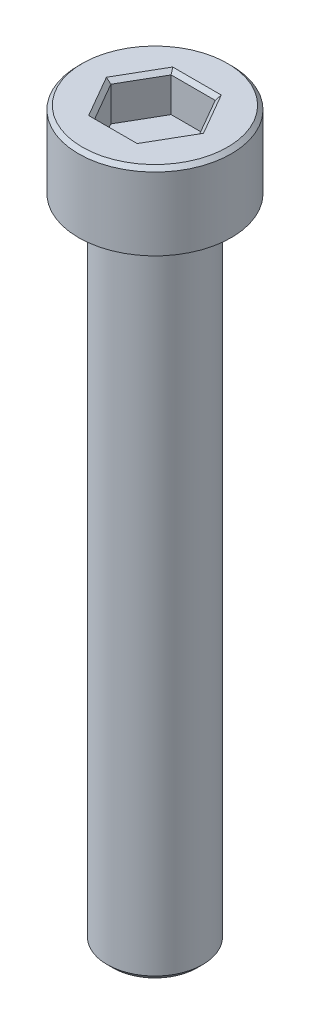
ISO-10303-21;
HEADER;
FILE_DESCRIPTION(('STEP AP214'),'2;1');
FILE_NAME('part.step','',(''),(''),'','','');
FILE_SCHEMA(('AUTOMOTIVE_DESIGN { 1 0 10303 214 1 1 1 1 }'));
ENDSEC;
DATA;
#1=APPLICATION_CONTEXT('core data for automotive mechanical design processes');
#2=APPLICATION_PROTOCOL_DEFINITION('international standard','automotive_design',2000,#1);
#3=PRODUCT_CONTEXT('',#1,'mechanical');
#4=PRODUCT('Part','Part','',(#3));
#5=PRODUCT_RELATED_PRODUCT_CATEGORY('part','',(#4));
#6=PRODUCT_DEFINITION_FORMATION('','',#4);
#7=PRODUCT_DEFINITION_CONTEXT('part definition',#1,'design');
#8=PRODUCT_DEFINITION('design','',#6,#7);
#9=PRODUCT_DEFINITION_SHAPE('','',#8);
#10=(LENGTH_UNIT() NAMED_UNIT(*) SI_UNIT(.MILLI.,.METRE.));
#11=(NAMED_UNIT(*) PLANE_ANGLE_UNIT() SI_UNIT($,.RADIAN.));
#12=(NAMED_UNIT(*) SI_UNIT($,.STERADIAN.) SOLID_ANGLE_UNIT());
#13=UNCERTAINTY_MEASURE_WITH_UNIT(LENGTH_MEASURE(1.E-05),#10,'distance_accuracy_value','');
#14=(GEOMETRIC_REPRESENTATION_CONTEXT(3) GLOBAL_UNCERTAINTY_ASSIGNED_CONTEXT((#13)) GLOBAL_UNIT_ASSIGNED_CONTEXT((#10,
#11,#12)) REPRESENTATION_CONTEXT('',''));
#15=CARTESIAN_POINT('',(0.,0.,0.));
#16=DIRECTION('',(0.,0.,1.));
#17=DIRECTION('',(1.,0.,0.));
#18=AXIS2_PLACEMENT_3D('',#15,#16,#17);
#19=CARTESIAN_POINT('',(0.,4.,0.));
#20=DIRECTION('',(0.,-1.,0.));
#21=DIRECTION('',(0.,0.,-1.));
#22=AXIS2_PLACEMENT_3D('',#19,#20,#21);
#23=CYLINDRICAL_SURFACE('',#22,4.);
#24=CARTESIAN_POINT('',(0.,3.80000000000001,0.));
#25=DIRECTION('',(0.,1.,0.));
#26=DIRECTION('',(0.,0.,1.));
#27=AXIS2_PLACEMENT_3D('',#24,#25,#26);
#28=CIRCLE('',#27,4.);
#29=CARTESIAN_POINT('',(0.,3.80000000000001,4.));
#30=VERTEX_POINT('',#29);
#31=EDGE_CURVE('E182',#30,#30,#28,.F.);
#32=ORIENTED_EDGE('',*,*,#31,.T.);
#33=EDGE_LOOP('',(#32));
#34=FACE_BOUND('',#33,.T.);
#35=CARTESIAN_POINT('',(0.,0.,0.));
#36=DIRECTION('',(0.,1.,0.));
#37=DIRECTION('',(0.,0.,1.));
#38=AXIS2_PLACEMENT_3D('',#35,#36,#37);
#39=CIRCLE('',#38,4.);
#40=CARTESIAN_POINT('',(0.,0.,4.));
#41=VERTEX_POINT('',#40);
#42=EDGE_CURVE('E152',#41,#41,#39,.T.);
#43=ORIENTED_EDGE('',*,*,#42,.T.);
#44=EDGE_LOOP('',(#43));
#45=FACE_BOUND('',#44,.T.);
#46=ADVANCED_FACE('F39',(#34,#45),#23,.T.);
#47=CARTESIAN_POINT('',(0.,4.,0.));
#48=DIRECTION('',(0.,1.,0.));
#49=DIRECTION('',(0.,0.,1.));
#50=AXIS2_PLACEMENT_3D('',#47,#48,#49);
#51=PLANE('',#50);
#52=CARTESIAN_POINT('',(0.,4.,0.));
#53=DIRECTION('',(0.,1.,0.));
#54=DIRECTION('',(0.,0.,1.));
#55=AXIS2_PLACEMENT_3D('',#52,#53,#54);
#56=CIRCLE('',#55,3.80000000000001);
#57=CARTESIAN_POINT('',(0.,4.,3.80000000000001));
#58=VERTEX_POINT('',#57);
#59=EDGE_CURVE('E179',#58,#58,#56,.T.);
#60=ORIENTED_EDGE('',*,*,#59,.T.);
#61=EDGE_LOOP('',(#60));
#62=FACE_BOUND('',#61,.T.);
#63=DIRECTION('',(0.500109828527989,0.,-0.865961984967992));
#64=VECTOR('',#63,1.);
#65=CARTESIAN_POINT('',(-1.32763927867956,4.,-2.10016839302008));
#66=LINE('',#65,#64);
#67=CARTESIAN_POINT('',(-2.5403411640046,4.,-0.000322175477219456));
#68=VERTEX_POINT('',#67);
#69=CARTESIAN_POINT('',(-1.26989156985455,4.,-2.20016107004593));
#70=VERTEX_POINT('',#69);
#71=EDGE_CURVE('E174',#68,#70,#66,.T.);
#72=ORIENTED_EDGE('',*,*,#71,.T.);
#73=DIRECTION('',(0.999999991957874,0.,0.00012682370352176));
#74=VECTOR('',#73,1.);
#75=CARTESIAN_POINT('',(1.15497954124075,4.,-2.19985353890858));
#76=LINE('',#75,#74);
#77=CARTESIAN_POINT('',(1.27044959415005,4.,-2.19983889456871));
#78=VERTEX_POINT('',#77);
#79=EDGE_CURVE('E176',#70,#78,#76,.T.);
#80=ORIENTED_EDGE('',*,*,#79,.T.);
#81=DIRECTION('',(0.499890163429886,0.,0.866088808671514));
#82=VECTOR('',#81,1.);
#83=CARTESIAN_POINT('',(2.48261881992031,4.,-0.0996851458885039));
#84=LINE('',#83,#82);
#85=CARTESIAN_POINT('',(2.5403411640046,4.,0.000322175477218123));
#86=VERTEX_POINT('',#85);
#87=EDGE_CURVE('E166',#78,#86,#84,.T.);
#88=ORIENTED_EDGE('',*,*,#87,.T.);
#89=DIRECTION('',(-0.500109828527989,0.,0.865961984967992));
#90=VECTOR('',#89,1.);
#91=CARTESIAN_POINT('',(1.32763927867956,4.,2.10016839302008));
#92=LINE('',#91,#90);
#93=CARTESIAN_POINT('',(1.26989156985455,4.,2.20016107004593));
#94=VERTEX_POINT('',#93);
#95=EDGE_CURVE('E168',#86,#94,#92,.T.);
#96=ORIENTED_EDGE('',*,*,#95,.T.);
#97=DIRECTION('',(-0.999999991957874,0.,-0.000126823703521948));
#98=VECTOR('',#97,1.);
#99=CARTESIAN_POINT('',(-1.15497954124075,4.,2.19985353890858));
#100=LINE('',#99,#98);
#101=CARTESIAN_POINT('',(-1.27044959415005,4.,2.19983889456871));
#102=VERTEX_POINT('',#101);
#103=EDGE_CURVE('E170',#94,#102,#100,.T.);
#104=ORIENTED_EDGE('',*,*,#103,.T.);
#105=DIRECTION('',(-0.499890163429885,0.,-0.866088808671514));
#106=VECTOR('',#105,1.);
#107=CARTESIAN_POINT('',(-2.48261881992031,4.,0.0996851458885026));
#108=LINE('',#107,#106);
#109=EDGE_CURVE('E172',#102,#68,#108,.T.);
#110=ORIENTED_EDGE('',*,*,#109,.T.);
#111=EDGE_LOOP('',(#72,#80,#88,#96,#104,#110));
#112=FACE_BOUND('',#111,.T.);
#113=ADVANCED_FACE('F221',(#62,#112),#51,.T.);
#114=CARTESIAN_POINT('',(0.,0.,0.));
#115=DIRECTION('',(0.,1.,0.));
#116=DIRECTION('',(0.,0.,1.));
#117=AXIS2_PLACEMENT_3D('',#114,#115,#116);
#118=PLANE('',#117);
#119=CARTESIAN_POINT('',(0.,0.,0.));
#120=DIRECTION('',(0.,1.,0.));
#121=DIRECTION('',(0.,0.,1.));
#122=AXIS2_PLACEMENT_3D('',#119,#120,#121);
#123=CIRCLE('',#122,2.5);
#124=CARTESIAN_POINT('',(0.,0.,2.5));
#125=VERTEX_POINT('',#124);
#126=EDGE_CURVE('E163',#125,#125,#123,.F.);
#127=ORIENTED_EDGE('',*,*,#126,.F.);
#128=EDGE_LOOP('',(#127));
#129=FACE_BOUND('',#128,.T.);
#130=ORIENTED_EDGE('',*,*,#42,.F.);
#131=EDGE_LOOP('',(#130));
#132=FACE_BOUND('',#131,.T.);
#133=ADVANCED_FACE('F227',(#129,#132),#118,.F.);
#134=CARTESIAN_POINT('',(0.,-34.,0.));
#135=DIRECTION('',(0.,1.,0.));
#136=DIRECTION('',(0.,0.,1.));
#137=AXIS2_PLACEMENT_3D('',#134,#135,#136);
#138=CYLINDRICAL_SURFACE('',#137,2.5);
#139=CARTESIAN_POINT('',(0.,-33.7,0.));
#140=DIRECTION('',(0.,-1.,0.));
#141=DIRECTION('',(0.,0.,-1.));
#142=AXIS2_PLACEMENT_3D('',#139,#140,#141);
#143=CIRCLE('',#142,2.5);
#144=CARTESIAN_POINT('',(0.,-33.7,-2.5));
#145=VERTEX_POINT('',#144);
#146=EDGE_CURVE('E11',#145,#145,#143,.F.);
#147=ORIENTED_EDGE('',*,*,#146,.T.);
#148=EDGE_LOOP('',(#147));
#149=FACE_BOUND('',#148,.T.);
#150=ORIENTED_EDGE('',*,*,#126,.T.);
#151=EDGE_LOOP('',(#150));
#152=FACE_BOUND('',#151,.T.);
#153=ADVANCED_FACE('F297',(#149,#152),#138,.T.);
#154=CARTESIAN_POINT('',(0.,-34.,0.));
#155=DIRECTION('',(0.,-1.,0.));
#156=DIRECTION('',(0.,0.,-1.));
#157=AXIS2_PLACEMENT_3D('',#154,#155,#156);
#158=PLANE('',#157);
#159=CARTESIAN_POINT('',(0.,-34.,0.));
#160=DIRECTION('',(0.,-1.,0.));
#161=DIRECTION('',(0.,0.,-1.));
#162=AXIS2_PLACEMENT_3D('',#159,#160,#161);
#163=CIRCLE('',#162,2.2);
#164=CARTESIAN_POINT('',(0.,-34.,-2.2));
#165=VERTEX_POINT('',#164);
#166=EDGE_CURVE('E47',#165,#165,#163,.T.);
#167=ORIENTED_EDGE('',*,*,#166,.T.);
#168=EDGE_LOOP('',(#167));
#169=FACE_BOUND('',#168,.T.);
#170=ADVANCED_FACE('F208',(#169),#158,.T.);
#171=CARTESIAN_POINT('',(2.30940105818601,2.,0.000292886797471428));
#172=DIRECTION('',(0.866088808671514,0.,-0.499890163429886));
#173=DIRECTION('',(-0.499890163429886,0.,-0.866088808671514));
#174=AXIS2_PLACEMENT_3D('',#171,#172,#173);
#175=PLANE('',#174);
#176=DIRECTION('',(0.,1.,0.));
#177=VECTOR('',#176,1.);
#178=CARTESIAN_POINT('',(2.30940105818601,2.,0.000292886797471428));
#179=LINE('',#178,#177);
#180=CARTESIAN_POINT('',(2.30940105818601,2.,0.000292886797471428));
#181=VERTEX_POINT('',#180);
#182=CARTESIAN_POINT('',(2.30940105818601,3.8,0.000292886797471428));
#183=VERTEX_POINT('',#182);
#184=EDGE_CURVE('E150',#181,#183,#179,.T.);
#185=ORIENTED_EDGE('',*,*,#184,.T.);
#186=DIRECTION('',(-0.499890163429886,0.,-0.866088808671514));
#187=VECTOR('',#186,1.);
#188=CARTESIAN_POINT('',(1.15495417650005,3.8,-1.99985354051701));
#189=LINE('',#188,#187);
#190=CARTESIAN_POINT('',(1.15495417650005,3.8,-1.99985354051701));
#191=VERTEX_POINT('',#190);
#192=EDGE_CURVE('E118',#183,#191,#189,.T.);
#193=ORIENTED_EDGE('',*,*,#192,.T.);
#194=DIRECTION('',(0.,1.,0.));
#195=VECTOR('',#194,1.);
#196=CARTESIAN_POINT('',(1.15495417650005,2.,-1.99985354051701));
#197=LINE('',#196,#195);
#198=CARTESIAN_POINT('',(1.15495417650005,2.,-1.99985354051701));
#199=VERTEX_POINT('',#198);
#200=EDGE_CURVE('E111',#199,#191,#197,.T.);
#201=ORIENTED_EDGE('',*,*,#200,.F.);
#202=DIRECTION('',(-0.499890163429885,0.,-0.866088808671514));
#203=VECTOR('',#202,1.);
#204=CARTESIAN_POINT('',(2.30940105818601,2.,0.000292886797471428));
#205=LINE('',#204,#203);
#206=EDGE_CURVE('E115',#181,#199,#205,.T.);
#207=ORIENTED_EDGE('',*,*,#206,.F.);
#208=EDGE_LOOP('',(#185,#193,#201,#207));
#209=FACE_BOUND('',#208,.T.);
#210=ADVANCED_FACE('F113',(#209),#175,.F.);
#211=CARTESIAN_POINT('',(1.15444688168596,2.,2.00014642731448));
#212=DIRECTION('',(0.865961984967992,0.,0.500109828527989));
#213=DIRECTION('',(0.500109828527989,0.,-0.865961984967992));
#214=AXIS2_PLACEMENT_3D('',#211,#212,#213);
#215=PLANE('',#214);
#216=DIRECTION('',(0.,1.,0.));
#217=VECTOR('',#216,1.);
#218=CARTESIAN_POINT('',(1.15444688168596,2.,2.00014642731448));
#219=LINE('',#218,#217);
#220=CARTESIAN_POINT('',(1.15444688168596,2.,2.00014642731448));
#221=VERTEX_POINT('',#220);
#222=CARTESIAN_POINT('',(1.15444688168596,3.8,2.00014642731448));
#223=VERTEX_POINT('',#222);
#224=EDGE_CURVE('E153',#221,#223,#219,.T.);
#225=ORIENTED_EDGE('',*,*,#224,.T.);
#226=DIRECTION('',(0.500109828527989,0.,-0.865961984967992));
#227=VECTOR('',#226,1.);
#228=CARTESIAN_POINT('',(2.30940105818601,3.8,0.000292886797471405));
#229=LINE('',#228,#227);
#230=EDGE_CURVE('E54',#223,#183,#229,.T.);
#231=ORIENTED_EDGE('',*,*,#230,.T.);
#232=ORIENTED_EDGE('',*,*,#184,.F.);
#233=DIRECTION('',(0.500109828527989,0.,-0.865961984967992));
#234=VECTOR('',#233,1.);
#235=CARTESIAN_POINT('',(1.15444688168596,2.,2.00014642731448));
#236=LINE('',#235,#234);
#237=EDGE_CURVE('E123',#221,#181,#236,.T.);
#238=ORIENTED_EDGE('',*,*,#237,.F.);
#239=EDGE_LOOP('',(#225,#231,#232,#238));
#240=FACE_BOUND('',#239,.T.);
#241=ADVANCED_FACE('F278',(#240),#215,.F.);
#242=CARTESIAN_POINT('',(-1.15495417650005,2.,1.99985354051701));
#243=DIRECTION('',(-0.000126823703521948,0.,0.999999991957874));
#244=DIRECTION('',(0.999999991957874,0.,0.000126823703521948));
#245=AXIS2_PLACEMENT_3D('',#242,#243,#244);
#246=PLANE('',#245);
#247=DIRECTION('',(0.,1.,0.));
#248=VECTOR('',#247,1.);
#249=CARTESIAN_POINT('',(-1.15495417650005,2.,1.99985354051701));
#250=LINE('',#249,#248);
#251=CARTESIAN_POINT('',(-1.15495417650005,2.,1.99985354051701));
#252=VERTEX_POINT('',#251);
#253=CARTESIAN_POINT('',(-1.15495417650005,3.8,1.99985354051701));
#254=VERTEX_POINT('',#253);
#255=EDGE_CURVE('E155',#252,#254,#250,.T.);
#256=ORIENTED_EDGE('',*,*,#255,.T.);
#257=DIRECTION('',(0.999999991957874,0.,0.000126823703521948));
#258=VECTOR('',#257,1.);
#259=CARTESIAN_POINT('',(1.15444688168596,3.8,2.00014642731448));
#260=LINE('',#259,#258);
#261=EDGE_CURVE('E62',#254,#223,#260,.T.);
#262=ORIENTED_EDGE('',*,*,#261,.T.);
#263=ORIENTED_EDGE('',*,*,#224,.F.);
#264=DIRECTION('',(0.999999991957874,0.,0.000126823703521948));
#265=VECTOR('',#264,1.);
#266=CARTESIAN_POINT('',(-1.15495417650005,2.,1.99985354051701));
#267=LINE('',#266,#265);
#268=EDGE_CURVE('E147',#252,#221,#267,.T.);
#269=ORIENTED_EDGE('',*,*,#268,.F.);
#270=EDGE_LOOP('',(#256,#262,#263,#269));
#271=FACE_BOUND('',#270,.T.);
#272=ADVANCED_FACE('F277',(#271),#246,.F.);
#273=CARTESIAN_POINT('',(-2.30940105818601,2.,-0.00029288679747257));
#274=DIRECTION('',(-0.866088808671514,0.,0.499890163429885));
#275=DIRECTION('',(0.499890163429885,0.,0.866088808671514));
#276=AXIS2_PLACEMENT_3D('',#273,#274,#275);
#277=PLANE('',#276);
#278=DIRECTION('',(0.,1.,0.));
#279=VECTOR('',#278,1.);
#280=CARTESIAN_POINT('',(-2.30940105818601,2.,-0.00029288679747257));
#281=LINE('',#280,#279);
#282=CARTESIAN_POINT('',(-2.30940105818601,2.,-0.00029288679747257));
#283=VERTEX_POINT('',#282);
#284=CARTESIAN_POINT('',(-2.30940105818601,3.8,-0.00029288679747257));
#285=VERTEX_POINT('',#284);
#286=EDGE_CURVE('E157',#283,#285,#281,.T.);
#287=ORIENTED_EDGE('',*,*,#286,.T.);
#288=DIRECTION('',(0.499890163429885,0.,0.866088808671514));
#289=VECTOR('',#288,1.);
#290=CARTESIAN_POINT('',(-1.15495417650005,3.8,1.99985354051701));
#291=LINE('',#290,#289);
#292=EDGE_CURVE('E189',#285,#254,#291,.T.);
#293=ORIENTED_EDGE('',*,*,#292,.T.);
#294=ORIENTED_EDGE('',*,*,#255,.F.);
#295=DIRECTION('',(0.499890163429885,0.,0.866088808671514));
#296=VECTOR('',#295,1.);
#297=CARTESIAN_POINT('',(-2.30940105818601,2.,-0.00029288679747257));
#298=LINE('',#297,#296);
#299=EDGE_CURVE('E144',#283,#252,#298,.T.);
#300=ORIENTED_EDGE('',*,*,#299,.F.);
#301=EDGE_LOOP('',(#287,#293,#294,#300));
#302=FACE_BOUND('',#301,.T.);
#303=ADVANCED_FACE('F276',(#302),#277,.F.);
#304=CARTESIAN_POINT('',(-1.15444688168596,2.,-2.00014642731448));
#305=DIRECTION('',(-0.865961984967992,0.,-0.500109828527989));
#306=DIRECTION('',(-0.500109828527989,0.,0.865961984967992));
#307=AXIS2_PLACEMENT_3D('',#304,#305,#306);
#308=PLANE('',#307);
#309=DIRECTION('',(0.,1.,0.));
#310=VECTOR('',#309,1.);
#311=CARTESIAN_POINT('',(-1.15444688168596,2.,-2.00014642731448));
#312=LINE('',#311,#310);
#313=CARTESIAN_POINT('',(-1.15444688168596,2.,-2.00014642731448));
#314=VERTEX_POINT('',#313);
#315=CARTESIAN_POINT('',(-1.15444688168596,3.8,-2.00014642731448));
#316=VERTEX_POINT('',#315);
#317=EDGE_CURVE('E122',#314,#316,#312,.T.);
#318=ORIENTED_EDGE('',*,*,#317,.T.);
#319=DIRECTION('',(-0.500109828527989,0.,0.865961984967992));
#320=VECTOR('',#319,1.);
#321=CARTESIAN_POINT('',(-2.30940105818601,3.8,-0.000292886797472603));
#322=LINE('',#321,#320);
#323=EDGE_CURVE('E187',#316,#285,#322,.T.);
#324=ORIENTED_EDGE('',*,*,#323,.T.);
#325=ORIENTED_EDGE('',*,*,#286,.F.);
#326=DIRECTION('',(-0.500109828527989,0.,0.865961984967992));
#327=VECTOR('',#326,1.);
#328=CARTESIAN_POINT('',(-1.15444688168596,2.,-2.00014642731448));
#329=LINE('',#328,#327);
#330=EDGE_CURVE('E132',#314,#283,#329,.T.);
#331=ORIENTED_EDGE('',*,*,#330,.F.);
#332=EDGE_LOOP('',(#318,#324,#325,#331));
#333=FACE_BOUND('',#332,.T.);
#334=ADVANCED_FACE('F272',(#333),#308,.F.);
#335=CARTESIAN_POINT('',(1.15495417650005,2.,-1.99985354051701));
#336=DIRECTION('',(0.00012682370352176,0.,-0.999999991957874));
#337=DIRECTION('',(-0.999999991957874,0.,-0.00012682370352176));
#338=AXIS2_PLACEMENT_3D('',#335,#336,#337);
#339=PLANE('',#338);
#340=ORIENTED_EDGE('',*,*,#200,.T.);
#341=DIRECTION('',(-0.999999991957874,0.,-0.00012682370352176));
#342=VECTOR('',#341,1.);
#343=CARTESIAN_POINT('',(-1.15444688168596,3.8,-2.00014642731448));
#344=LINE('',#343,#342);
#345=EDGE_CURVE('E185',#191,#316,#344,.T.);
#346=ORIENTED_EDGE('',*,*,#345,.T.);
#347=ORIENTED_EDGE('',*,*,#317,.F.);
#348=DIRECTION('',(-0.999999991957874,0.,-0.00012682370352176));
#349=VECTOR('',#348,1.);
#350=CARTESIAN_POINT('',(1.15495417650005,2.,-1.99985354051701));
#351=LINE('',#350,#349);
#352=EDGE_CURVE('E126',#199,#314,#351,.T.);
#353=ORIENTED_EDGE('',*,*,#352,.F.);
#354=EDGE_LOOP('',(#340,#346,#347,#353));
#355=FACE_BOUND('',#354,.T.);
#356=ADVANCED_FACE('F127',(#355),#339,.F.);
#357=CARTESIAN_POINT('',(0.,2.,0.));
#358=DIRECTION('',(0.,1.,0.));
#359=DIRECTION('',(0.,0.,1.));
#360=AXIS2_PLACEMENT_3D('',#357,#358,#359);
#361=PLANE('',#360);
#362=ORIENTED_EDGE('',*,*,#206,.T.);
#363=ORIENTED_EDGE('',*,*,#352,.T.);
#364=ORIENTED_EDGE('',*,*,#330,.T.);
#365=ORIENTED_EDGE('',*,*,#299,.T.);
#366=ORIENTED_EDGE('',*,*,#268,.T.);
#367=ORIENTED_EDGE('',*,*,#237,.T.);
#368=EDGE_LOOP('',(#362,#363,#364,#365,#366,#367));
#369=FACE_BOUND('',#368,.T.);
#370=ADVANCED_FACE('F134',(#369),#361,.T.);
#371=CARTESIAN_POINT('',(0.,4.,0.));
#372=DIRECTION('',(0.,-1.,0.));
#373=DIRECTION('',(0.,0.,-1.));
#374=AXIS2_PLACEMENT_3D('',#371,#372,#373);
#375=CONICAL_SURFACE('',#374,3.80000000000001,0.78539816339744);
#376=ORIENTED_EDGE('',*,*,#31,.F.);
#377=EDGE_LOOP('',(#376));
#378=FACE_BOUND('',#377,.T.);
#379=ORIENTED_EDGE('',*,*,#59,.F.);
#380=EDGE_LOOP('',(#379));
#381=FACE_BOUND('',#380,.T.);
#382=ADVANCED_FACE('F233',(#378,#381),#375,.T.);
#383=CARTESIAN_POINT('',(-1.15495417650005,3.8,1.99985354051701));
#384=DIRECTION('',(8.96779007755614E-05,0.707106781186549,-0.707106775499904));
#385=DIRECTION('',(-0.999999991957874,0.,-0.000126823703521948));
#386=AXIS2_PLACEMENT_3D('',#383,#384,#385);
#387=PLANE('',#386);
#388=DIRECTION('',(-0.378047495572634,0.654653670707976,0.654605730588904));
#389=VECTOR('',#388,1.);
#390=CARTESIAN_POINT('',(-0.824967268928604,3.22857142857143,1.42846681465501));
#391=LINE('',#390,#389);
#392=EDGE_CURVE('E140',#102,#254,#391,.F.);
#393=ORIENTED_EDGE('',*,*,#392,.F.);
#394=ORIENTED_EDGE('',*,*,#103,.F.);
#395=DIRECTION('',(0.377881444366547,0.654653670707976,0.654701600297438));
#396=VECTOR('',#395,1.);
#397=CARTESIAN_POINT('',(0.82460491548997,3.22857142857143,1.42867601951034));
#398=LINE('',#397,#396);
#399=EDGE_CURVE('E137',#223,#94,#398,.T.);
#400=ORIENTED_EDGE('',*,*,#399,.F.);
#401=ORIENTED_EDGE('',*,*,#261,.F.);
#402=EDGE_LOOP('',(#393,#394,#400,#401));
#403=FACE_BOUND('',#402,.T.);
#404=ADVANCED_FACE('F235',(#403),#387,.T.);
#405=CARTESIAN_POINT('',(1.15444688168596,3.8,2.00014642731448));
#406=DIRECTION('',(-0.612327591820629,0.707106781186549,-0.353631051090182));
#407=DIRECTION('',(-0.500109828527989,0.,0.865961984967992));
#408=AXIS2_PLACEMENT_3D('',#405,#406,#407);
#409=PLANE('',#408);
#410=ORIENTED_EDGE('',*,*,#399,.T.);
#411=ORIENTED_EDGE('',*,*,#95,.F.);
#412=DIRECTION('',(0.75592893993918,0.654653670707975,9.58697085323821E-05));
#413=VECTOR('',#412,1.);
#414=CARTESIAN_POINT('',(1.64957218441857,3.22857142857143,0.000209204855337267));
#415=LINE('',#414,#413);
#416=EDGE_CURVE('E201',#183,#86,#415,.T.);
#417=ORIENTED_EDGE('',*,*,#416,.F.);
#418=ORIENTED_EDGE('',*,*,#230,.F.);
#419=EDGE_LOOP('',(#410,#411,#417,#418));
#420=FACE_BOUND('',#419,.T.);
#421=ADVANCED_FACE('F248',(#420),#409,.T.);
#422=CARTESIAN_POINT('',(-2.30940105818601,3.8,-0.00029288679747257));
#423=DIRECTION('',(0.612417269721405,0.707106781186549,-0.353475724409722));
#424=DIRECTION('',(-0.499890163429885,0.,-0.866088808671514));
#425=AXIS2_PLACEMENT_3D('',#422,#423,#424);
#426=PLANE('',#425);
#427=ORIENTED_EDGE('',*,*,#392,.T.);
#428=ORIENTED_EDGE('',*,*,#292,.F.);
#429=DIRECTION('',(-0.75592893993918,0.654653670707976,-9.5869708532476E-05));
#430=VECTOR('',#429,1.);
#431=CARTESIAN_POINT('',(-1.64957218441857,3.22857142857143,-0.000209204855338568));
#432=LINE('',#431,#430);
#433=EDGE_CURVE('E198',#68,#285,#432,.F.);
#434=ORIENTED_EDGE('',*,*,#433,.F.);
#435=ORIENTED_EDGE('',*,*,#109,.F.);
#436=EDGE_LOOP('',(#427,#428,#434,#435));
#437=FACE_BOUND('',#436,.T.);
#438=ADVANCED_FACE('F244',(#437),#426,.T.);
#439=CARTESIAN_POINT('',(2.30940105818601,3.8,0.000292886797471428));
#440=DIRECTION('',(-0.612417269721404,0.707106781186549,0.353475724409723));
#441=DIRECTION('',(0.499890163429886,0.,0.866088808671514));
#442=AXIS2_PLACEMENT_3D('',#439,#440,#441);
#443=PLANE('',#442);
#444=ORIENTED_EDGE('',*,*,#416,.T.);
#445=ORIENTED_EDGE('',*,*,#87,.F.);
#446=DIRECTION('',(-0.378047495572632,-0.654653670707975,0.654605730588906));
#447=VECTOR('',#446,1.);
#448=CARTESIAN_POINT('',(1.15495417650005,3.8,-1.99985354051701));
#449=LINE('',#448,#447);
#450=EDGE_CURVE('E196',#191,#78,#449,.F.);
#451=ORIENTED_EDGE('',*,*,#450,.F.);
#452=ORIENTED_EDGE('',*,*,#192,.F.);
#453=EDGE_LOOP('',(#444,#445,#451,#452));
#454=FACE_BOUND('',#453,.T.);
#455=ADVANCED_FACE('F240',(#454),#443,.T.);
#456=CARTESIAN_POINT('',(-1.15444688168596,3.8,-2.00014642731448));
#457=DIRECTION('',(0.61232759182063,0.707106781186549,0.353631051090182));
#458=DIRECTION('',(0.500109828527989,0.,-0.865961984967992));
#459=AXIS2_PLACEMENT_3D('',#456,#457,#458);
#460=PLANE('',#459);
#461=ORIENTED_EDGE('',*,*,#433,.T.);
#462=ORIENTED_EDGE('',*,*,#323,.F.);
#463=DIRECTION('',(-0.377881444366544,0.654653670707975,-0.65470160029744));
#464=VECTOR('',#463,1.);
#465=CARTESIAN_POINT('',(-0.824604915489976,3.22857142857144,-1.42867601951034));
#466=LINE('',#465,#464);
#467=EDGE_CURVE('E194',#70,#316,#466,.F.);
#468=ORIENTED_EDGE('',*,*,#467,.F.);
#469=ORIENTED_EDGE('',*,*,#71,.F.);
#470=EDGE_LOOP('',(#461,#462,#468,#469));
#471=FACE_BOUND('',#470,.T.);
#472=ADVANCED_FACE('F216',(#471),#460,.T.);
#473=CARTESIAN_POINT('',(1.15495417650005,3.8,-1.99985354051701));
#474=DIRECTION('',(-8.96779007754285E-05,0.70710678118655,0.707106775499903));
#475=DIRECTION('',(0.999999991957874,0.,0.00012682370352176));
#476=AXIS2_PLACEMENT_3D('',#473,#474,#475);
#477=PLANE('',#476);
#478=ORIENTED_EDGE('',*,*,#450,.T.);
#479=ORIENTED_EDGE('',*,*,#79,.F.);
#480=ORIENTED_EDGE('',*,*,#467,.T.);
#481=ORIENTED_EDGE('',*,*,#345,.F.);
#482=EDGE_LOOP('',(#478,#479,#480,#481));
#483=FACE_BOUND('',#482,.T.);
#484=ADVANCED_FACE('F211',(#483),#477,.T.);
#485=CARTESIAN_POINT('',(0.,-34.,0.));
#486=DIRECTION('',(0.,1.,0.));
#487=DIRECTION('',(0.,0.,1.));
#488=AXIS2_PLACEMENT_3D('',#485,#486,#487);
#489=CONICAL_SURFACE('',#488,2.2,0.785398163397456);
#490=ORIENTED_EDGE('',*,*,#146,.F.);
#491=EDGE_LOOP('',(#490));
#492=FACE_BOUND('',#491,.T.);
#493=ORIENTED_EDGE('',*,*,#166,.F.);
#494=EDGE_LOOP('',(#493));
#495=FACE_BOUND('',#494,.T.);
#496=ADVANCED_FACE('F41',(#492,#495),#489,.T.);
#497=CLOSED_SHELL('',(#46,#113,#133,#153,#170,#210,#241,#272,#303,#334,#356,#370,#382,#404,#421,
#438,#455,#472,#484,#496));
#498=MANIFOLD_SOLID_BREP('B2',#497);
#499=ADVANCED_BREP_SHAPE_REPRESENTATION('',(#18,#498),#14);
#500=SHAPE_DEFINITION_REPRESENTATION(#9,#499);
ENDSEC;
END-ISO-10303-21;
